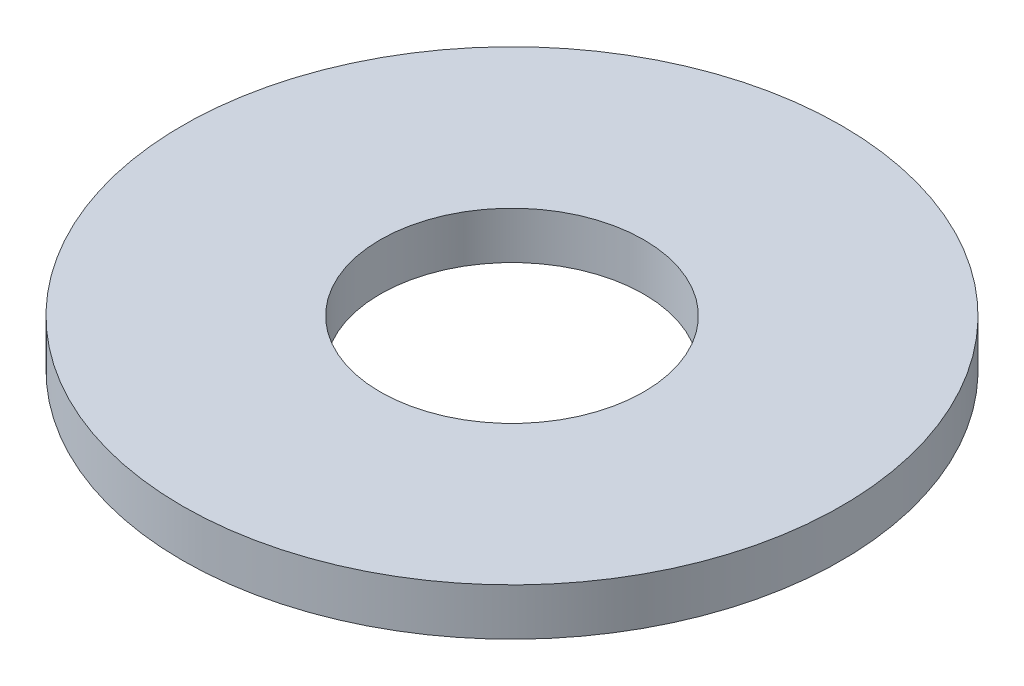
ISO-10303-21;
HEADER;
FILE_DESCRIPTION(('STEP AP214'),'2;1');
FILE_NAME('part.step','',(''),(''),'','','');
FILE_SCHEMA(('AUTOMOTIVE_DESIGN { 1 0 10303 214 1 1 1 1 }'));
ENDSEC;
DATA;
#1=APPLICATION_CONTEXT('core data for automotive mechanical design processes');
#2=APPLICATION_PROTOCOL_DEFINITION('international standard','automotive_design',2000,#1);
#3=PRODUCT_CONTEXT('',#1,'mechanical');
#4=PRODUCT('Part','Part','',(#3));
#5=PRODUCT_RELATED_PRODUCT_CATEGORY('part','',(#4));
#6=PRODUCT_DEFINITION_FORMATION('','',#4);
#7=PRODUCT_DEFINITION_CONTEXT('part definition',#1,'design');
#8=PRODUCT_DEFINITION('design','',#6,#7);
#9=PRODUCT_DEFINITION_SHAPE('','',#8);
#10=(LENGTH_UNIT() NAMED_UNIT(*) SI_UNIT(.MILLI.,.METRE.));
#11=(NAMED_UNIT(*) PLANE_ANGLE_UNIT() SI_UNIT($,.RADIAN.));
#12=(NAMED_UNIT(*) SI_UNIT($,.STERADIAN.) SOLID_ANGLE_UNIT());
#13=UNCERTAINTY_MEASURE_WITH_UNIT(LENGTH_MEASURE(1.E-05),#10,'distance_accuracy_value','');
#14=(GEOMETRIC_REPRESENTATION_CONTEXT(3) GLOBAL_UNCERTAINTY_ASSIGNED_CONTEXT((#13)) GLOBAL_UNIT_ASSIGNED_CONTEXT((#10,
#11,#12)) REPRESENTATION_CONTEXT('',''));
#15=CARTESIAN_POINT('',(0.,0.,0.));
#16=DIRECTION('',(0.,0.,1.));
#17=DIRECTION('',(1.,0.,0.));
#18=AXIS2_PLACEMENT_3D('',#15,#16,#17);
#19=CARTESIAN_POINT('',(0.,0.5,0.));
#20=DIRECTION('',(0.,1.,0.));
#21=DIRECTION('',(0.,0.,1.));
#22=AXIS2_PLACEMENT_3D('',#19,#20,#21);
#23=PLANE('',#22);
#24=CARTESIAN_POINT('',(0.,0.5,0.));
#25=DIRECTION('',(0.,1.,0.));
#26=DIRECTION('',(0.,0.,1.));
#27=AXIS2_PLACEMENT_3D('',#24,#25,#26);
#28=CIRCLE('',#27,3.5);
#29=CARTESIAN_POINT('',(0.,0.5,3.5));
#30=VERTEX_POINT('',#29);
#31=EDGE_CURVE('E10',#30,#30,#28,.T.);
#32=ORIENTED_EDGE('',*,*,#31,.T.);
#33=EDGE_LOOP('',(#32));
#34=FACE_BOUND('',#33,.T.);
#35=CARTESIAN_POINT('',(0.,0.5,0.));
#36=DIRECTION('',(0.,1.,0.));
#37=DIRECTION('',(0.,0.,1.));
#38=AXIS2_PLACEMENT_3D('',#35,#36,#37);
#39=CIRCLE('',#38,1.4);
#40=CARTESIAN_POINT('',(0.,0.5,1.4));
#41=VERTEX_POINT('',#40);
#42=EDGE_CURVE('E46',#41,#41,#39,.T.);
#43=ORIENTED_EDGE('',*,*,#42,.F.);
#44=EDGE_LOOP('',(#43));
#45=FACE_BOUND('',#44,.T.);
#46=ADVANCED_FACE('F35',(#34,#45),#23,.T.);
#47=CARTESIAN_POINT('',(0.,0.,0.));
#48=DIRECTION('',(0.,1.,0.));
#49=DIRECTION('',(0.,0.,1.));
#50=AXIS2_PLACEMENT_3D('',#47,#48,#49);
#51=PLANE('',#50);
#52=CARTESIAN_POINT('',(0.,0.,0.));
#53=DIRECTION('',(0.,1.,0.));
#54=DIRECTION('',(0.,0.,1.));
#55=AXIS2_PLACEMENT_3D('',#52,#53,#54);
#56=CIRCLE('',#55,3.5);
#57=CARTESIAN_POINT('',(0.,0.,3.5));
#58=VERTEX_POINT('',#57);
#59=EDGE_CURVE('E39',#58,#58,#56,.T.);
#60=ORIENTED_EDGE('',*,*,#59,.F.);
#61=EDGE_LOOP('',(#60));
#62=FACE_BOUND('',#61,.T.);
#63=CARTESIAN_POINT('',(0.,0.,0.));
#64=DIRECTION('',(0.,1.,0.));
#65=DIRECTION('',(0.,0.,1.));
#66=AXIS2_PLACEMENT_3D('',#63,#64,#65);
#67=CIRCLE('',#66,1.4);
#68=CARTESIAN_POINT('',(0.,0.,1.4));
#69=VERTEX_POINT('',#68);
#70=EDGE_CURVE('E48',#69,#69,#67,.T.);
#71=ORIENTED_EDGE('',*,*,#70,.T.);
#72=EDGE_LOOP('',(#71));
#73=FACE_BOUND('',#72,.T.);
#74=ADVANCED_FACE('F58',(#62,#73),#51,.F.);
#75=CARTESIAN_POINT('',(0.,0.5,0.));
#76=DIRECTION('',(0.,-1.,0.));
#77=DIRECTION('',(0.,0.,-1.));
#78=AXIS2_PLACEMENT_3D('',#75,#76,#77);
#79=CYLINDRICAL_SURFACE('',#78,3.5);
#80=ORIENTED_EDGE('',*,*,#31,.F.);
#81=EDGE_LOOP('',(#80));
#82=FACE_BOUND('',#81,.T.);
#83=ORIENTED_EDGE('',*,*,#59,.T.);
#84=EDGE_LOOP('',(#83));
#85=FACE_BOUND('',#84,.T.);
#86=ADVANCED_FACE('F37',(#82,#85),#79,.T.);
#87=CARTESIAN_POINT('',(0.,0.5,0.));
#88=DIRECTION('',(0.,-1.,0.));
#89=DIRECTION('',(0.,0.,-1.));
#90=AXIS2_PLACEMENT_3D('',#87,#88,#89);
#91=CYLINDRICAL_SURFACE('',#90,1.4);
#92=ORIENTED_EDGE('',*,*,#42,.T.);
#93=EDGE_LOOP('',(#92));
#94=FACE_BOUND('',#93,.T.);
#95=ORIENTED_EDGE('',*,*,#70,.F.);
#96=EDGE_LOOP('',(#95));
#97=FACE_BOUND('',#96,.T.);
#98=ADVANCED_FACE('F54',(#94,#97),#91,.F.);
#99=CLOSED_SHELL('',(#46,#74,#86,#98));
#100=MANIFOLD_SOLID_BREP('B2',#99);
#101=ADVANCED_BREP_SHAPE_REPRESENTATION('',(#18,#100),#14);
#102=SHAPE_DEFINITION_REPRESENTATION(#9,#101);
ENDSEC;
END-ISO-10303-21;
